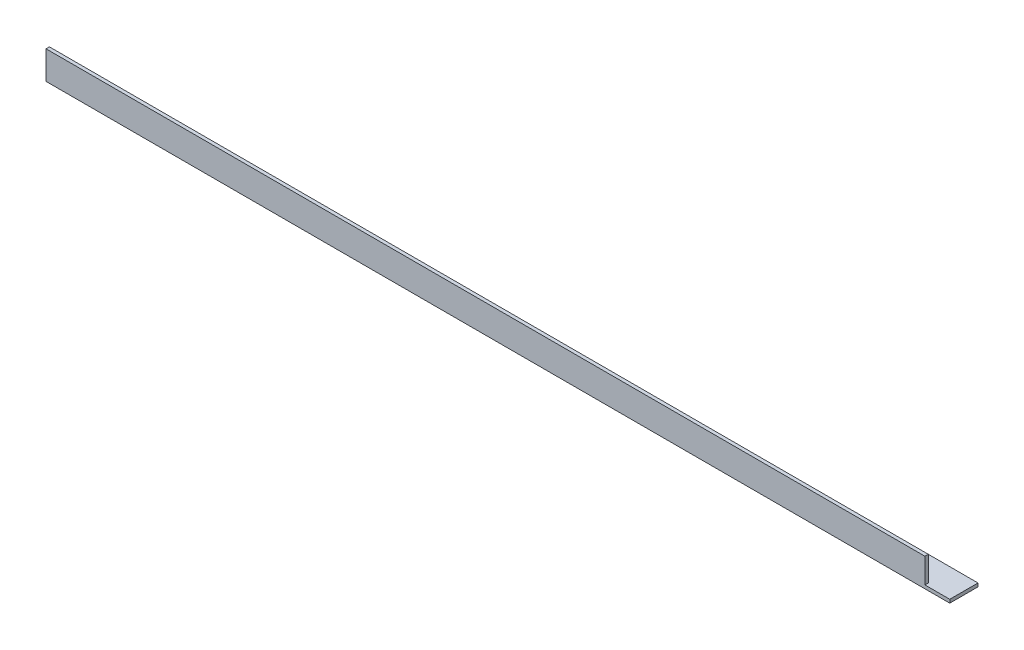
ISO-10303-21;
HEADER;
FILE_DESCRIPTION(('STEP AP214'),'2;1');
FILE_NAME('part.step','',(''),(''),'','','');
FILE_SCHEMA(('AUTOMOTIVE_DESIGN { 1 0 10303 214 1 1 1 1 }'));
ENDSEC;
DATA;
#1=APPLICATION_CONTEXT('core data for automotive mechanical design processes');
#2=APPLICATION_PROTOCOL_DEFINITION('international standard','automotive_design',2000,#1);
#3=PRODUCT_CONTEXT('',#1,'mechanical');
#4=PRODUCT('Part','Part','',(#3));
#5=PRODUCT_RELATED_PRODUCT_CATEGORY('part','',(#4));
#6=PRODUCT_DEFINITION_FORMATION('','',#4);
#7=PRODUCT_DEFINITION_CONTEXT('part definition',#1,'design');
#8=PRODUCT_DEFINITION('design','',#6,#7);
#9=PRODUCT_DEFINITION_SHAPE('','',#8);
#10=(LENGTH_UNIT() NAMED_UNIT(*) SI_UNIT(.MILLI.,.METRE.));
#11=(NAMED_UNIT(*) PLANE_ANGLE_UNIT() SI_UNIT($,.RADIAN.));
#12=(NAMED_UNIT(*) SI_UNIT($,.STERADIAN.) SOLID_ANGLE_UNIT());
#13=UNCERTAINTY_MEASURE_WITH_UNIT(LENGTH_MEASURE(1.E-05),#10,'distance_accuracy_value','');
#14=(GEOMETRIC_REPRESENTATION_CONTEXT(3) GLOBAL_UNCERTAINTY_ASSIGNED_CONTEXT((#13)) GLOBAL_UNIT_ASSIGNED_CONTEXT((#10,
#11,#12)) REPRESENTATION_CONTEXT('',''));
#15=CARTESIAN_POINT('',(0.,0.,0.));
#16=DIRECTION('',(0.,0.,1.));
#17=DIRECTION('',(1.,0.,0.));
#18=AXIS2_PLACEMENT_3D('',#15,#16,#17);
#19=CARTESIAN_POINT('',(800.,0.,-3.));
#20=DIRECTION('',(0.,0.,1.));
#21=DIRECTION('',(1.,0.,0.));
#22=AXIS2_PLACEMENT_3D('',#19,#20,#21);
#23=PLANE('',#22);
#24=DIRECTION('',(-1.,0.,0.));
#25=VECTOR('',#24,1.);
#26=CARTESIAN_POINT('',(800.,25.,-3.));
#27=LINE('',#26,#25);
#28=CARTESIAN_POINT('',(778.,25.,-3.));
#29=VERTEX_POINT('',#28);
#30=CARTESIAN_POINT('',(0.,25.,-3.));
#31=VERTEX_POINT('',#30);
#32=EDGE_CURVE('E11',#29,#31,#27,.T.);
#33=ORIENTED_EDGE('',*,*,#32,.F.);
#34=DIRECTION('',(0.,1.,0.));
#35=VECTOR('',#34,1.);
#36=CARTESIAN_POINT('',(778.,25.,-3.));
#37=LINE('',#36,#35);
#38=CARTESIAN_POINT('',(778.,3.,-3.));
#39=VERTEX_POINT('',#38);
#40=EDGE_CURVE('E108',#39,#29,#37,.T.);
#41=ORIENTED_EDGE('',*,*,#40,.F.);
#42=DIRECTION('',(-1.,0.,0.));
#43=VECTOR('',#42,1.);
#44=CARTESIAN_POINT('',(800.,3.,-3.));
#45=LINE('',#44,#43);
#46=CARTESIAN_POINT('',(0.,3.,-3.));
#47=VERTEX_POINT('',#46);
#48=EDGE_CURVE('E82',#39,#47,#45,.T.);
#49=ORIENTED_EDGE('',*,*,#48,.T.);
#50=DIRECTION('',(0.,1.,0.));
#51=VECTOR('',#50,1.);
#52=CARTESIAN_POINT('',(0.,0.,-3.));
#53=LINE('',#52,#51);
#54=EDGE_CURVE('E140',#47,#31,#53,.T.);
#55=ORIENTED_EDGE('',*,*,#54,.T.);
#56=EDGE_LOOP('',(#33,#41,#49,#55));
#57=FACE_BOUND('',#56,.T.);
#58=ADVANCED_FACE('F34',(#57),#23,.F.);
#59=CARTESIAN_POINT('',(800.,25.,0.));
#60=DIRECTION('',(0.,1.,0.));
#61=DIRECTION('',(0.,0.,1.));
#62=AXIS2_PLACEMENT_3D('',#59,#60,#61);
#63=PLANE('',#62);
#64=DIRECTION('',(0.,0.,1.));
#65=VECTOR('',#64,1.);
#66=CARTESIAN_POINT('',(778.,25.,-25.001));
#67=LINE('',#66,#65);
#68=CARTESIAN_POINT('',(778.,25.,0.));
#69=VERTEX_POINT('',#68);
#70=EDGE_CURVE('E103',#29,#69,#67,.T.);
#71=ORIENTED_EDGE('',*,*,#70,.F.);
#72=ORIENTED_EDGE('',*,*,#32,.T.);
#73=DIRECTION('',(0.,0.,-1.));
#74=VECTOR('',#73,1.);
#75=CARTESIAN_POINT('',(0.,25.,0.));
#76=LINE('',#75,#74);
#77=CARTESIAN_POINT('',(0.,25.,0.));
#78=VERTEX_POINT('',#77);
#79=EDGE_CURVE('E120',#78,#31,#76,.T.);
#80=ORIENTED_EDGE('',*,*,#79,.F.);
#81=DIRECTION('',(-1.,0.,0.));
#82=VECTOR('',#81,1.);
#83=CARTESIAN_POINT('',(800.,25.,0.));
#84=LINE('',#83,#82);
#85=EDGE_CURVE('E41',#69,#78,#84,.T.);
#86=ORIENTED_EDGE('',*,*,#85,.F.);
#87=EDGE_LOOP('',(#71,#72,#80,#86));
#88=FACE_BOUND('',#87,.T.);
#89=ADVANCED_FACE('F118',(#88),#63,.T.);
#90=CARTESIAN_POINT('',(800.,0.,0.));
#91=DIRECTION('',(0.,0.,1.));
#92=DIRECTION('',(1.,0.,0.));
#93=AXIS2_PLACEMENT_3D('',#90,#91,#92);
#94=PLANE('',#93);
#95=DIRECTION('',(1.,0.,0.));
#96=VECTOR('',#95,1.);
#97=CARTESIAN_POINT('',(800.,3.,0.));
#98=LINE('',#97,#96);
#99=CARTESIAN_POINT('',(778.,3.,0.));
#100=VERTEX_POINT('',#99);
#101=CARTESIAN_POINT('',(800.,3.,0.));
#102=VERTEX_POINT('',#101);
#103=EDGE_CURVE('E113',#100,#102,#98,.T.);
#104=ORIENTED_EDGE('',*,*,#103,.F.);
#105=DIRECTION('',(0.,-1.,0.));
#106=VECTOR('',#105,1.);
#107=CARTESIAN_POINT('',(778.,25.,0.));
#108=LINE('',#107,#106);
#109=EDGE_CURVE('E106',#69,#100,#108,.T.);
#110=ORIENTED_EDGE('',*,*,#109,.F.);
#111=ORIENTED_EDGE('',*,*,#85,.T.);
#112=DIRECTION('',(0.,1.,0.));
#113=VECTOR('',#112,1.);
#114=CARTESIAN_POINT('',(0.,0.,0.));
#115=LINE('',#114,#113);
#116=CARTESIAN_POINT('',(0.,0.,0.));
#117=VERTEX_POINT('',#116);
#118=EDGE_CURVE('E137',#117,#78,#115,.T.);
#119=ORIENTED_EDGE('',*,*,#118,.F.);
#120=DIRECTION('',(-1.,0.,0.));
#121=VECTOR('',#120,1.);
#122=CARTESIAN_POINT('',(800.,0.,0.));
#123=LINE('',#122,#121);
#124=CARTESIAN_POINT('',(800.,0.,0.));
#125=VERTEX_POINT('',#124);
#126=EDGE_CURVE('E88',#125,#117,#123,.T.);
#127=ORIENTED_EDGE('',*,*,#126,.F.);
#128=DIRECTION('',(0.,1.,0.));
#129=VECTOR('',#128,1.);
#130=CARTESIAN_POINT('',(800.,0.,0.));
#131=LINE('',#130,#129);
#132=EDGE_CURVE('E130',#125,#102,#131,.T.);
#133=ORIENTED_EDGE('',*,*,#132,.T.);
#134=EDGE_LOOP('',(#104,#110,#111,#119,#127,#133));
#135=FACE_BOUND('',#134,.T.);
#136=ADVANCED_FACE('F115',(#135),#94,.T.);
#137=CARTESIAN_POINT('',(800.,0.,0.));
#138=DIRECTION('',(0.,-1.,0.));
#139=DIRECTION('',(0.,0.,-1.));
#140=AXIS2_PLACEMENT_3D('',#137,#138,#139);
#141=PLANE('',#140);
#142=DIRECTION('',(0.,0.,1.));
#143=VECTOR('',#142,1.);
#144=CARTESIAN_POINT('',(0.,0.,0.));
#145=LINE('',#144,#143);
#146=CARTESIAN_POINT('',(0.,0.,-25.));
#147=VERTEX_POINT('',#146);
#148=EDGE_CURVE('E134',#147,#117,#145,.T.);
#149=ORIENTED_EDGE('',*,*,#148,.F.);
#150=DIRECTION('',(-1.,0.,0.));
#151=VECTOR('',#150,1.);
#152=CARTESIAN_POINT('',(800.,0.,-25.));
#153=LINE('',#152,#151);
#154=CARTESIAN_POINT('',(800.,0.,-25.));
#155=VERTEX_POINT('',#154);
#156=EDGE_CURVE('E122',#155,#147,#153,.T.);
#157=ORIENTED_EDGE('',*,*,#156,.F.);
#158=DIRECTION('',(0.,0.,1.));
#159=VECTOR('',#158,1.);
#160=CARTESIAN_POINT('',(800.,0.,0.));
#161=LINE('',#160,#159);
#162=EDGE_CURVE('E145',#155,#125,#161,.T.);
#163=ORIENTED_EDGE('',*,*,#162,.T.);
#164=ORIENTED_EDGE('',*,*,#126,.T.);
#165=EDGE_LOOP('',(#149,#157,#163,#164));
#166=FACE_BOUND('',#165,.T.);
#167=ADVANCED_FACE('F157',(#166),#141,.T.);
#168=CARTESIAN_POINT('',(800.,3.,-25.));
#169=DIRECTION('',(0.,0.,-1.));
#170=DIRECTION('',(-1.,0.,0.));
#171=AXIS2_PLACEMENT_3D('',#168,#169,#170);
#172=PLANE('',#171);
#173=DIRECTION('',(0.,-1.,0.));
#174=VECTOR('',#173,1.);
#175=CARTESIAN_POINT('',(0.,3.,-25.));
#176=LINE('',#175,#174);
#177=CARTESIAN_POINT('',(0.,3.,-25.));
#178=VERTEX_POINT('',#177);
#179=EDGE_CURVE('E131',#178,#147,#176,.T.);
#180=ORIENTED_EDGE('',*,*,#179,.F.);
#181=DIRECTION('',(-1.,0.,0.));
#182=VECTOR('',#181,1.);
#183=CARTESIAN_POINT('',(800.,3.,-25.));
#184=LINE('',#183,#182);
#185=CARTESIAN_POINT('',(800.,3.,-25.));
#186=VERTEX_POINT('',#185);
#187=EDGE_CURVE('E57',#186,#178,#184,.T.);
#188=ORIENTED_EDGE('',*,*,#187,.F.);
#189=DIRECTION('',(0.,-1.,0.));
#190=VECTOR('',#189,1.);
#191=CARTESIAN_POINT('',(800.,3.,-25.));
#192=LINE('',#191,#190);
#193=EDGE_CURVE('E143',#186,#155,#192,.T.);
#194=ORIENTED_EDGE('',*,*,#193,.T.);
#195=ORIENTED_EDGE('',*,*,#156,.T.);
#196=EDGE_LOOP('',(#180,#188,#194,#195));
#197=FACE_BOUND('',#196,.T.);
#198=ADVANCED_FACE('F158',(#197),#172,.T.);
#199=CARTESIAN_POINT('',(800.,3.,0.));
#200=DIRECTION('',(0.,-1.,0.));
#201=DIRECTION('',(0.,0.,-1.));
#202=AXIS2_PLACEMENT_3D('',#199,#200,#201);
#203=PLANE('',#202);
#204=DIRECTION('',(0.,0.,-1.));
#205=VECTOR('',#204,1.);
#206=CARTESIAN_POINT('',(0.,3.,0.));
#207=LINE('',#206,#205);
#208=EDGE_CURVE('E128',#178,#47,#207,.F.);
#209=ORIENTED_EDGE('',*,*,#208,.T.);
#210=ORIENTED_EDGE('',*,*,#48,.F.);
#211=DIRECTION('',(0.,0.,1.));
#212=VECTOR('',#211,1.);
#213=CARTESIAN_POINT('',(778.,3.,-25.001));
#214=LINE('',#213,#212);
#215=EDGE_CURVE('E112',#39,#100,#214,.T.);
#216=ORIENTED_EDGE('',*,*,#215,.T.);
#217=ORIENTED_EDGE('',*,*,#103,.T.);
#218=DIRECTION('',(0.,0.,-1.));
#219=VECTOR('',#218,1.);
#220=CARTESIAN_POINT('',(800.,3.,0.));
#221=LINE('',#220,#219);
#222=EDGE_CURVE('E48',#186,#102,#221,.F.);
#223=ORIENTED_EDGE('',*,*,#222,.F.);
#224=ORIENTED_EDGE('',*,*,#187,.T.);
#225=EDGE_LOOP('',(#209,#210,#216,#217,#223,#224));
#226=FACE_BOUND('',#225,.T.);
#227=ADVANCED_FACE('F152',(#226),#203,.F.);
#228=CARTESIAN_POINT('',(800.,0.,0.));
#229=DIRECTION('',(-1.,0.,0.));
#230=DIRECTION('',(0.,0.,1.));
#231=AXIS2_PLACEMENT_3D('',#228,#229,#230);
#232=PLANE('',#231);
#233=ORIENTED_EDGE('',*,*,#222,.T.);
#234=ORIENTED_EDGE('',*,*,#132,.F.);
#235=ORIENTED_EDGE('',*,*,#162,.F.);
#236=ORIENTED_EDGE('',*,*,#193,.F.);
#237=EDGE_LOOP('',(#233,#234,#235,#236));
#238=FACE_BOUND('',#237,.T.);
#239=ADVANCED_FACE('F154',(#238),#232,.F.);
#240=CARTESIAN_POINT('',(0.,0.,0.));
#241=DIRECTION('',(-1.,0.,0.));
#242=DIRECTION('',(0.,0.,1.));
#243=AXIS2_PLACEMENT_3D('',#240,#241,#242);
#244=PLANE('',#243);
#245=ORIENTED_EDGE('',*,*,#54,.F.);
#246=ORIENTED_EDGE('',*,*,#208,.F.);
#247=ORIENTED_EDGE('',*,*,#179,.T.);
#248=ORIENTED_EDGE('',*,*,#148,.T.);
#249=ORIENTED_EDGE('',*,*,#118,.T.);
#250=ORIENTED_EDGE('',*,*,#79,.T.);
#251=EDGE_LOOP('',(#245,#246,#247,#248,#249,#250));
#252=FACE_BOUND('',#251,.T.);
#253=ADVANCED_FACE('F162',(#252),#244,.T.);
#254=CARTESIAN_POINT('',(778.,25.,-25.001));
#255=DIRECTION('',(-1.,0.,0.));
#256=DIRECTION('',(0.,0.,1.));
#257=AXIS2_PLACEMENT_3D('',#254,#255,#256);
#258=PLANE('',#257);
#259=ORIENTED_EDGE('',*,*,#40,.T.);
#260=ORIENTED_EDGE('',*,*,#70,.T.);
#261=ORIENTED_EDGE('',*,*,#109,.T.);
#262=ORIENTED_EDGE('',*,*,#215,.F.);
#263=EDGE_LOOP('',(#259,#260,#261,#262));
#264=FACE_BOUND('',#263,.T.);
#265=ADVANCED_FACE('F105',(#264),#258,.F.);
#266=CLOSED_SHELL('',(#58,#89,#136,#167,#198,#227,#239,#253,#265));
#267=MANIFOLD_SOLID_BREP('B2',#266);
#268=ADVANCED_BREP_SHAPE_REPRESENTATION('',(#18,#267),#14);
#269=SHAPE_DEFINITION_REPRESENTATION(#9,#268);
ENDSEC;
END-ISO-10303-21;
